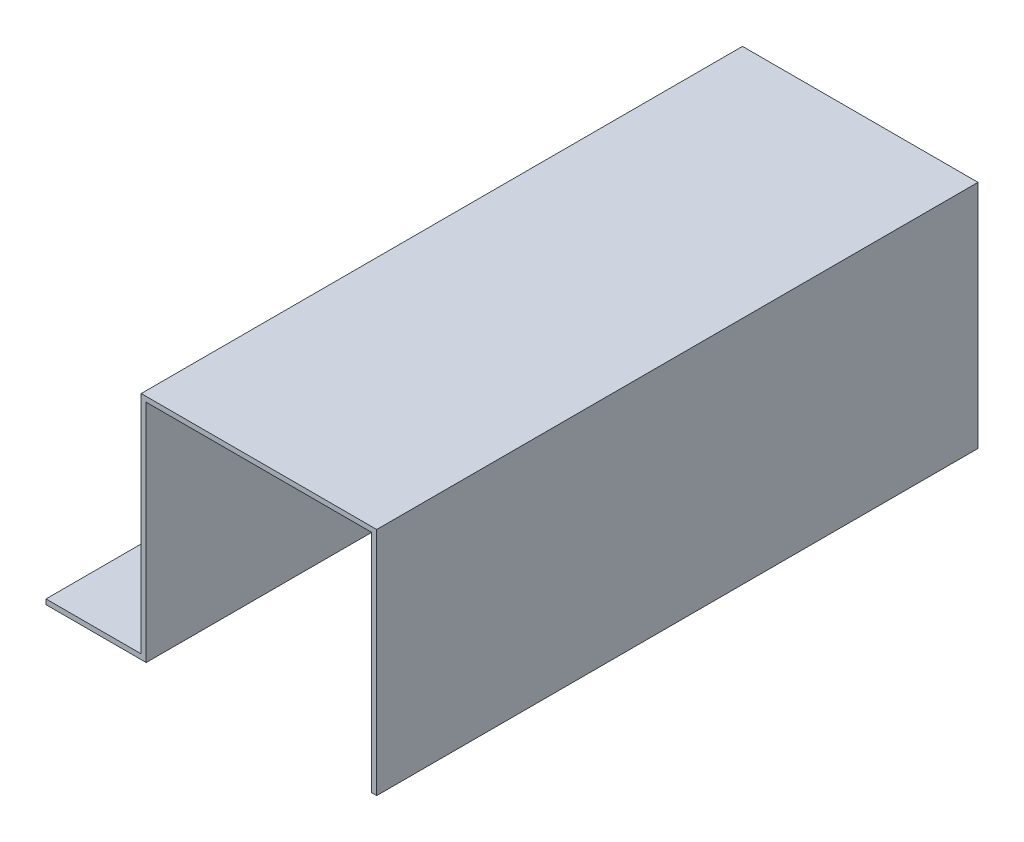
ISO-10303-21;
HEADER;
FILE_DESCRIPTION(('STEP AP214'),'2;1');
FILE_NAME('part.step','',(''),(''),'','','');
FILE_SCHEMA(('AUTOMOTIVE_DESIGN { 1 0 10303 214 1 1 1 1 }'));
ENDSEC;
DATA;
#1=APPLICATION_CONTEXT('core data for automotive mechanical design processes');
#2=APPLICATION_PROTOCOL_DEFINITION('international standard','automotive_design',2000,#1);
#3=PRODUCT_CONTEXT('',#1,'mechanical');
#4=PRODUCT('Part','Part','',(#3));
#5=PRODUCT_RELATED_PRODUCT_CATEGORY('part','',(#4));
#6=PRODUCT_DEFINITION_FORMATION('','',#4);
#7=PRODUCT_DEFINITION_CONTEXT('part definition',#1,'design');
#8=PRODUCT_DEFINITION('design','',#6,#7);
#9=PRODUCT_DEFINITION_SHAPE('','',#8);
#10=(LENGTH_UNIT() NAMED_UNIT(*) SI_UNIT(.MILLI.,.METRE.));
#11=(NAMED_UNIT(*) PLANE_ANGLE_UNIT() SI_UNIT($,.RADIAN.));
#12=(NAMED_UNIT(*) SI_UNIT($,.STERADIAN.) SOLID_ANGLE_UNIT());
#13=UNCERTAINTY_MEASURE_WITH_UNIT(LENGTH_MEASURE(1.E-05),#10,'distance_accuracy_value','');
#14=(GEOMETRIC_REPRESENTATION_CONTEXT(3) GLOBAL_UNCERTAINTY_ASSIGNED_CONTEXT((#13)) GLOBAL_UNIT_ASSIGNED_CONTEXT((#10,
#11,#12)) REPRESENTATION_CONTEXT('',''));
#15=CARTESIAN_POINT('',(0.,0.,0.));
#16=DIRECTION('',(0.,0.,1.));
#17=DIRECTION('',(1.,0.,0.));
#18=AXIS2_PLACEMENT_3D('',#15,#16,#17);
#19=CARTESIAN_POINT('',(0.,0.,120.));
#20=DIRECTION('',(1.,0.,0.));
#21=DIRECTION('',(0.,0.,-1.));
#22=AXIS2_PLACEMENT_3D('',#19,#20,#21);
#23=PLANE('',#22);
#24=DIRECTION('',(0.,-1.,0.));
#25=VECTOR('',#24,1.);
#26=CARTESIAN_POINT('',(0.,0.,0.));
#27=LINE('',#26,#25);
#28=CARTESIAN_POINT('',(0.,1.,0.));
#29=VERTEX_POINT('',#28);
#30=CARTESIAN_POINT('',(0.,0.,0.));
#31=VERTEX_POINT('',#30);
#32=EDGE_CURVE('E151',#29,#31,#27,.T.);
#33=ORIENTED_EDGE('',*,*,#32,.T.);
#34=DIRECTION('',(0.,0.,-1.));
#35=VECTOR('',#34,1.);
#36=CARTESIAN_POINT('',(0.,0.,120.));
#37=LINE('',#36,#35);
#38=CARTESIAN_POINT('',(0.,0.,120.));
#39=VERTEX_POINT('',#38);
#40=EDGE_CURVE('E11',#39,#31,#37,.T.);
#41=ORIENTED_EDGE('',*,*,#40,.F.);
#42=DIRECTION('',(0.,-1.,0.));
#43=VECTOR('',#42,1.);
#44=CARTESIAN_POINT('',(0.,0.,120.));
#45=LINE('',#44,#43);
#46=CARTESIAN_POINT('',(0.,1.,120.));
#47=VERTEX_POINT('',#46);
#48=EDGE_CURVE('E180',#47,#39,#45,.T.);
#49=ORIENTED_EDGE('',*,*,#48,.F.);
#50=DIRECTION('',(0.,0.,-1.));
#51=VECTOR('',#50,1.);
#52=CARTESIAN_POINT('',(0.,1.,120.));
#53=LINE('',#52,#51);
#54=EDGE_CURVE('E147',#47,#29,#53,.T.);
#55=ORIENTED_EDGE('',*,*,#54,.T.);
#56=EDGE_LOOP('',(#33,#41,#49,#55));
#57=FACE_BOUND('',#56,.T.);
#58=ADVANCED_FACE('F38',(#57),#23,.F.);
#59=CARTESIAN_POINT('',(0.,0.,120.));
#60=DIRECTION('',(0.,1.,0.));
#61=DIRECTION('',(0.,0.,1.));
#62=AXIS2_PLACEMENT_3D('',#59,#60,#61);
#63=PLANE('',#62);
#64=CARTESIAN_POINT('',(9.5,0.,30.));
#65=DIRECTION('',(0.,1.,0.));
#66=DIRECTION('',(0.,0.,1.));
#67=AXIS2_PLACEMENT_3D('',#64,#65,#66);
#68=CIRCLE('',#67,2.65);
#69=CARTESIAN_POINT('',(9.5,0.,32.65));
#70=VERTEX_POINT('',#69);
#71=EDGE_CURVE('E156',#70,#70,#68,.T.);
#72=ORIENTED_EDGE('',*,*,#71,.T.);
#73=EDGE_LOOP('',(#72));
#74=FACE_BOUND('',#73,.T.);
#75=CARTESIAN_POINT('',(9.50000000000001,0.,90.));
#76=DIRECTION('',(0.,1.,0.));
#77=DIRECTION('',(0.,0.,1.));
#78=AXIS2_PLACEMENT_3D('',#75,#76,#77);
#79=CIRCLE('',#78,2.65000000000001);
#80=CARTESIAN_POINT('',(9.50000000000001,0.,92.65));
#81=VERTEX_POINT('',#80);
#82=EDGE_CURVE('E245',#81,#81,#79,.T.);
#83=ORIENTED_EDGE('',*,*,#82,.T.);
#84=EDGE_LOOP('',(#83));
#85=FACE_BOUND('',#84,.T.);
#86=DIRECTION('',(1.,0.,0.));
#87=VECTOR('',#86,1.);
#88=CARTESIAN_POINT('',(0.,0.,0.));
#89=LINE('',#88,#87);
#90=CARTESIAN_POINT('',(20.,0.,0.));
#91=VERTEX_POINT('',#90);
#92=EDGE_CURVE('E155',#31,#91,#89,.T.);
#93=ORIENTED_EDGE('',*,*,#92,.T.);
#94=DIRECTION('',(0.,0.,-1.));
#95=VECTOR('',#94,1.);
#96=CARTESIAN_POINT('',(20.,0.,120.));
#97=LINE('',#96,#95);
#98=CARTESIAN_POINT('',(20.,0.,120.));
#99=VERTEX_POINT('',#98);
#100=EDGE_CURVE('E47',#99,#91,#97,.T.);
#101=ORIENTED_EDGE('',*,*,#100,.F.);
#102=DIRECTION('',(1.,0.,0.));
#103=VECTOR('',#102,1.);
#104=CARTESIAN_POINT('',(0.,0.,120.));
#105=LINE('',#104,#103);
#106=EDGE_CURVE('E104',#39,#99,#105,.T.);
#107=ORIENTED_EDGE('',*,*,#106,.F.);
#108=ORIENTED_EDGE('',*,*,#40,.T.);
#109=EDGE_LOOP('',(#93,#101,#107,#108));
#110=FACE_BOUND('',#109,.T.);
#111=ADVANCED_FACE('F273',(#74,#85,#110),#63,.F.);
#112=CARTESIAN_POINT('',(20.,0.,120.));
#113=DIRECTION('',(-1.,0.,0.));
#114=DIRECTION('',(0.,0.,1.));
#115=AXIS2_PLACEMENT_3D('',#112,#113,#114);
#116=PLANE('',#115);
#117=DIRECTION('',(0.,1.,0.));
#118=VECTOR('',#117,1.);
#119=CARTESIAN_POINT('',(20.,0.,0.));
#120=LINE('',#119,#118);
#121=CARTESIAN_POINT('',(20.,45.,0.));
#122=VERTEX_POINT('',#121);
#123=EDGE_CURVE('E159',#91,#122,#120,.T.);
#124=ORIENTED_EDGE('',*,*,#123,.T.);
#125=DIRECTION('',(0.,0.,-1.));
#126=VECTOR('',#125,1.);
#127=CARTESIAN_POINT('',(20.,45.,120.));
#128=LINE('',#127,#126);
#129=CARTESIAN_POINT('',(20.,45.,120.));
#130=VERTEX_POINT('',#129);
#131=EDGE_CURVE('E199',#130,#122,#128,.T.);
#132=ORIENTED_EDGE('',*,*,#131,.F.);
#133=DIRECTION('',(0.,1.,0.));
#134=VECTOR('',#133,1.);
#135=CARTESIAN_POINT('',(20.,0.,120.));
#136=LINE('',#135,#134);
#137=EDGE_CURVE('E209',#99,#130,#136,.T.);
#138=ORIENTED_EDGE('',*,*,#137,.F.);
#139=ORIENTED_EDGE('',*,*,#100,.T.);
#140=EDGE_LOOP('',(#124,#132,#138,#139));
#141=FACE_BOUND('',#140,.T.);
#142=ADVANCED_FACE('F207',(#141),#116,.F.);
#143=CARTESIAN_POINT('',(20.,45.,120.));
#144=DIRECTION('',(0.,1.,0.));
#145=DIRECTION('',(0.,0.,1.));
#146=AXIS2_PLACEMENT_3D('',#143,#144,#145);
#147=PLANE('',#146);
#148=DIRECTION('',(1.,0.,0.));
#149=VECTOR('',#148,1.);
#150=CARTESIAN_POINT('',(20.,45.,0.));
#151=LINE('',#150,#149);
#152=CARTESIAN_POINT('',(65.,45.,0.));
#153=VERTEX_POINT('',#152);
#154=EDGE_CURVE('E162',#122,#153,#151,.T.);
#155=ORIENTED_EDGE('',*,*,#154,.T.);
#156=DIRECTION('',(0.,0.,-1.));
#157=VECTOR('',#156,1.);
#158=CARTESIAN_POINT('',(65.,45.,120.));
#159=LINE('',#158,#157);
#160=CARTESIAN_POINT('',(65.,45.,120.));
#161=VERTEX_POINT('',#160);
#162=EDGE_CURVE('E195',#161,#153,#159,.T.);
#163=ORIENTED_EDGE('',*,*,#162,.F.);
#164=DIRECTION('',(1.,0.,0.));
#165=VECTOR('',#164,1.);
#166=CARTESIAN_POINT('',(20.,45.,120.));
#167=LINE('',#166,#165);
#168=EDGE_CURVE('E228',#130,#161,#167,.T.);
#169=ORIENTED_EDGE('',*,*,#168,.F.);
#170=ORIENTED_EDGE('',*,*,#131,.T.);
#171=EDGE_LOOP('',(#155,#163,#169,#170));
#172=FACE_BOUND('',#171,.T.);
#173=ADVANCED_FACE('F218',(#172),#147,.F.);
#174=CARTESIAN_POINT('',(65.,45.,120.));
#175=DIRECTION('',(1.,0.,0.));
#176=DIRECTION('',(0.,0.,-1.));
#177=AXIS2_PLACEMENT_3D('',#174,#175,#176);
#178=PLANE('',#177);
#179=DIRECTION('',(0.,-1.,0.));
#180=VECTOR('',#179,1.);
#181=CARTESIAN_POINT('',(65.,45.,0.));
#182=LINE('',#181,#180);
#183=CARTESIAN_POINT('',(65.,0.,0.));
#184=VERTEX_POINT('',#183);
#185=EDGE_CURVE('E165',#153,#184,#182,.T.);
#186=ORIENTED_EDGE('',*,*,#185,.T.);
#187=DIRECTION('',(0.,0.,-1.));
#188=VECTOR('',#187,1.);
#189=CARTESIAN_POINT('',(65.,0.,120.));
#190=LINE('',#189,#188);
#191=CARTESIAN_POINT('',(65.,0.,120.));
#192=VERTEX_POINT('',#191);
#193=EDGE_CURVE('E191',#192,#184,#190,.T.);
#194=ORIENTED_EDGE('',*,*,#193,.F.);
#195=DIRECTION('',(0.,-1.,0.));
#196=VECTOR('',#195,1.);
#197=CARTESIAN_POINT('',(65.,45.,120.));
#198=LINE('',#197,#196);
#199=EDGE_CURVE('E224',#161,#192,#198,.T.);
#200=ORIENTED_EDGE('',*,*,#199,.F.);
#201=ORIENTED_EDGE('',*,*,#162,.T.);
#202=EDGE_LOOP('',(#186,#194,#200,#201));
#203=FACE_BOUND('',#202,.T.);
#204=ADVANCED_FACE('F222',(#203),#178,.F.);
#205=CARTESIAN_POINT('',(66.,0.,120.));
#206=DIRECTION('',(0.,1.,0.));
#207=DIRECTION('',(-1.,0.,0.));
#208=AXIS2_PLACEMENT_3D('',#205,#206,#207);
#209=PLANE('',#208);
#210=DIRECTION('',(1.,0.,0.));
#211=VECTOR('',#210,1.);
#212=CARTESIAN_POINT('',(66.,0.,0.));
#213=LINE('',#212,#211);
#214=CARTESIAN_POINT('',(66.,0.,0.));
#215=VERTEX_POINT('',#214);
#216=EDGE_CURVE('E168',#184,#215,#213,.T.);
#217=ORIENTED_EDGE('',*,*,#216,.T.);
#218=DIRECTION('',(0.,0.,-1.));
#219=VECTOR('',#218,1.);
#220=CARTESIAN_POINT('',(66.,0.,120.));
#221=LINE('',#220,#219);
#222=CARTESIAN_POINT('',(66.,0.,120.));
#223=VERTEX_POINT('',#222);
#224=EDGE_CURVE('E187',#223,#215,#221,.T.);
#225=ORIENTED_EDGE('',*,*,#224,.F.);
#226=DIRECTION('',(1.,0.,0.));
#227=VECTOR('',#226,1.);
#228=CARTESIAN_POINT('',(66.,0.,120.));
#229=LINE('',#228,#227);
#230=EDGE_CURVE('E227',#192,#223,#229,.T.);
#231=ORIENTED_EDGE('',*,*,#230,.F.);
#232=ORIENTED_EDGE('',*,*,#193,.T.);
#233=EDGE_LOOP('',(#217,#225,#231,#232));
#234=FACE_BOUND('',#233,.T.);
#235=ADVANCED_FACE('F284',(#234),#209,.F.);
#236=CARTESIAN_POINT('',(66.,46.,120.));
#237=DIRECTION('',(-1.,0.,0.));
#238=DIRECTION('',(0.,0.,1.));
#239=AXIS2_PLACEMENT_3D('',#236,#237,#238);
#240=PLANE('',#239);
#241=DIRECTION('',(0.,1.,0.));
#242=VECTOR('',#241,1.);
#243=CARTESIAN_POINT('',(66.,46.,0.));
#244=LINE('',#243,#242);
#245=CARTESIAN_POINT('',(66.,46.,0.));
#246=VERTEX_POINT('',#245);
#247=EDGE_CURVE('E171',#215,#246,#244,.T.);
#248=ORIENTED_EDGE('',*,*,#247,.T.);
#249=DIRECTION('',(0.,0.,-1.));
#250=VECTOR('',#249,1.);
#251=CARTESIAN_POINT('',(66.,46.,120.));
#252=LINE('',#251,#250);
#253=CARTESIAN_POINT('',(66.,46.,120.));
#254=VERTEX_POINT('',#253);
#255=EDGE_CURVE('E140',#254,#246,#252,.T.);
#256=ORIENTED_EDGE('',*,*,#255,.F.);
#257=DIRECTION('',(0.,1.,0.));
#258=VECTOR('',#257,1.);
#259=CARTESIAN_POINT('',(66.,46.,120.));
#260=LINE('',#259,#258);
#261=EDGE_CURVE('E129',#223,#254,#260,.T.);
#262=ORIENTED_EDGE('',*,*,#261,.F.);
#263=ORIENTED_EDGE('',*,*,#224,.T.);
#264=EDGE_LOOP('',(#248,#256,#262,#263));
#265=FACE_BOUND('',#264,.T.);
#266=ADVANCED_FACE('F281',(#265),#240,.F.);
#267=CARTESIAN_POINT('',(19.,46.,120.));
#268=DIRECTION('',(0.,-1.,0.));
#269=DIRECTION('',(0.,0.,-1.));
#270=AXIS2_PLACEMENT_3D('',#267,#268,#269);
#271=PLANE('',#270);
#272=DIRECTION('',(-1.,0.,0.));
#273=VECTOR('',#272,1.);
#274=CARTESIAN_POINT('',(19.,46.,0.));
#275=LINE('',#274,#273);
#276=CARTESIAN_POINT('',(19.,46.,0.));
#277=VERTEX_POINT('',#276);
#278=EDGE_CURVE('E138',#246,#277,#275,.T.);
#279=ORIENTED_EDGE('',*,*,#278,.T.);
#280=DIRECTION('',(0.,0.,-1.));
#281=VECTOR('',#280,1.);
#282=CARTESIAN_POINT('',(19.,46.,120.));
#283=LINE('',#282,#281);
#284=CARTESIAN_POINT('',(19.,46.,120.));
#285=VERTEX_POINT('',#284);
#286=EDGE_CURVE('E135',#285,#277,#283,.T.);
#287=ORIENTED_EDGE('',*,*,#286,.F.);
#288=DIRECTION('',(-1.,0.,0.));
#289=VECTOR('',#288,1.);
#290=CARTESIAN_POINT('',(19.,46.,120.));
#291=LINE('',#290,#289);
#292=EDGE_CURVE('E123',#254,#285,#291,.T.);
#293=ORIENTED_EDGE('',*,*,#292,.F.);
#294=ORIENTED_EDGE('',*,*,#255,.T.);
#295=EDGE_LOOP('',(#279,#287,#293,#294));
#296=FACE_BOUND('',#295,.T.);
#297=ADVANCED_FACE('F136',(#296),#271,.F.);
#298=CARTESIAN_POINT('',(19.,1.,120.));
#299=DIRECTION('',(1.,0.,0.));
#300=DIRECTION('',(0.,1.,0.));
#301=AXIS2_PLACEMENT_3D('',#298,#299,#300);
#302=PLANE('',#301);
#303=DIRECTION('',(0.,-1.,0.));
#304=VECTOR('',#303,1.);
#305=CARTESIAN_POINT('',(19.,1.,0.));
#306=LINE('',#305,#304);
#307=CARTESIAN_POINT('',(19.,1.,0.));
#308=VERTEX_POINT('',#307);
#309=EDGE_CURVE('E90',#277,#308,#306,.T.);
#310=ORIENTED_EDGE('',*,*,#309,.T.);
#311=DIRECTION('',(0.,0.,-1.));
#312=VECTOR('',#311,1.);
#313=CARTESIAN_POINT('',(19.,1.,120.));
#314=LINE('',#313,#312);
#315=CARTESIAN_POINT('',(19.,1.,120.));
#316=VERTEX_POINT('',#315);
#317=EDGE_CURVE('E141',#316,#308,#314,.T.);
#318=ORIENTED_EDGE('',*,*,#317,.F.);
#319=DIRECTION('',(0.,-1.,0.));
#320=VECTOR('',#319,1.);
#321=CARTESIAN_POINT('',(19.,1.,120.));
#322=LINE('',#321,#320);
#323=EDGE_CURVE('E127',#285,#316,#322,.T.);
#324=ORIENTED_EDGE('',*,*,#323,.F.);
#325=ORIENTED_EDGE('',*,*,#286,.T.);
#326=EDGE_LOOP('',(#310,#318,#324,#325));
#327=FACE_BOUND('',#326,.T.);
#328=ADVANCED_FACE('F143',(#327),#302,.F.);
#329=CARTESIAN_POINT('',(0.,1.,120.));
#330=DIRECTION('',(0.,-1.,0.));
#331=DIRECTION('',(0.,0.,-1.));
#332=AXIS2_PLACEMENT_3D('',#329,#330,#331);
#333=PLANE('',#332);
#334=CARTESIAN_POINT('',(9.5,1.,30.));
#335=DIRECTION('',(0.,1.,0.));
#336=DIRECTION('',(0.,0.,1.));
#337=AXIS2_PLACEMENT_3D('',#334,#335,#336);
#338=CIRCLE('',#337,2.65);
#339=CARTESIAN_POINT('',(9.5,1.,32.65));
#340=VERTEX_POINT('',#339);
#341=EDGE_CURVE('E249',#340,#340,#338,.T.);
#342=ORIENTED_EDGE('',*,*,#341,.F.);
#343=EDGE_LOOP('',(#342));
#344=FACE_BOUND('',#343,.T.);
#345=CARTESIAN_POINT('',(9.50000000000001,1.,90.));
#346=DIRECTION('',(0.,1.,0.));
#347=DIRECTION('',(0.,0.,1.));
#348=AXIS2_PLACEMENT_3D('',#345,#346,#347);
#349=CIRCLE('',#348,2.65000000000001);
#350=CARTESIAN_POINT('',(9.50000000000001,1.,92.65));
#351=VERTEX_POINT('',#350);
#352=EDGE_CURVE('E250',#351,#351,#349,.T.);
#353=ORIENTED_EDGE('',*,*,#352,.F.);
#354=EDGE_LOOP('',(#353));
#355=FACE_BOUND('',#354,.T.);
#356=DIRECTION('',(-1.,0.,0.));
#357=VECTOR('',#356,1.);
#358=CARTESIAN_POINT('',(0.,1.,0.));
#359=LINE('',#358,#357);
#360=EDGE_CURVE('E96',#308,#29,#359,.T.);
#361=ORIENTED_EDGE('',*,*,#360,.T.);
#362=ORIENTED_EDGE('',*,*,#54,.F.);
#363=DIRECTION('',(-1.,0.,0.));
#364=VECTOR('',#363,1.);
#365=CARTESIAN_POINT('',(0.,1.,120.));
#366=LINE('',#365,#364);
#367=EDGE_CURVE('E55',#316,#47,#366,.T.);
#368=ORIENTED_EDGE('',*,*,#367,.F.);
#369=ORIENTED_EDGE('',*,*,#317,.T.);
#370=EDGE_LOOP('',(#361,#362,#368,#369));
#371=FACE_BOUND('',#370,.T.);
#372=ADVANCED_FACE('F261',(#344,#355,#371),#333,.F.);
#373=CARTESIAN_POINT('',(0.,0.,120.));
#374=DIRECTION('',(0.,0.,-1.));
#375=DIRECTION('',(-1.,0.,0.));
#376=AXIS2_PLACEMENT_3D('',#373,#374,#375);
#377=PLANE('',#376);
#378=ORIENTED_EDGE('',*,*,#48,.T.);
#379=ORIENTED_EDGE('',*,*,#106,.T.);
#380=ORIENTED_EDGE('',*,*,#137,.T.);
#381=ORIENTED_EDGE('',*,*,#168,.T.);
#382=ORIENTED_EDGE('',*,*,#199,.T.);
#383=ORIENTED_EDGE('',*,*,#230,.T.);
#384=ORIENTED_EDGE('',*,*,#261,.T.);
#385=ORIENTED_EDGE('',*,*,#292,.T.);
#386=ORIENTED_EDGE('',*,*,#323,.T.);
#387=ORIENTED_EDGE('',*,*,#367,.T.);
#388=EDGE_LOOP('',(#378,#379,#380,#381,#382,#383,#384,#385,#386,#387));
#389=FACE_BOUND('',#388,.T.);
#390=ADVANCED_FACE('F125',(#389),#377,.F.);
#391=CARTESIAN_POINT('',(0.,0.,0.));
#392=DIRECTION('',(0.,0.,-1.));
#393=DIRECTION('',(-1.,0.,0.));
#394=AXIS2_PLACEMENT_3D('',#391,#392,#393);
#395=PLANE('',#394);
#396=ORIENTED_EDGE('',*,*,#32,.F.);
#397=ORIENTED_EDGE('',*,*,#360,.F.);
#398=ORIENTED_EDGE('',*,*,#309,.F.);
#399=ORIENTED_EDGE('',*,*,#278,.F.);
#400=ORIENTED_EDGE('',*,*,#247,.F.);
#401=ORIENTED_EDGE('',*,*,#216,.F.);
#402=ORIENTED_EDGE('',*,*,#185,.F.);
#403=ORIENTED_EDGE('',*,*,#154,.F.);
#404=ORIENTED_EDGE('',*,*,#123,.F.);
#405=ORIENTED_EDGE('',*,*,#92,.F.);
#406=EDGE_LOOP('',(#396,#397,#398,#399,#400,#401,#402,#403,#404,#405));
#407=FACE_BOUND('',#406,.T.);
#408=ADVANCED_FACE('F213',(#407),#395,.T.);
#409=CARTESIAN_POINT('',(9.50000000000001,-199.,90.));
#410=DIRECTION('',(0.,1.,0.));
#411=DIRECTION('',(0.,0.,1.));
#412=AXIS2_PLACEMENT_3D('',#409,#410,#411);
#413=CYLINDRICAL_SURFACE('',#412,2.65000000000001);
#414=ORIENTED_EDGE('',*,*,#352,.T.);
#415=EDGE_LOOP('',(#414));
#416=FACE_BOUND('',#415,.T.);
#417=ORIENTED_EDGE('',*,*,#82,.F.);
#418=EDGE_LOOP('',(#417));
#419=FACE_BOUND('',#418,.T.);
#420=ADVANCED_FACE('F267',(#416,#419),#413,.F.);
#421=CARTESIAN_POINT('',(9.5,-199.,30.));
#422=DIRECTION('',(0.,1.,0.));
#423=DIRECTION('',(0.,0.,1.));
#424=AXIS2_PLACEMENT_3D('',#421,#422,#423);
#425=CYLINDRICAL_SURFACE('',#424,2.65);
#426=ORIENTED_EDGE('',*,*,#341,.T.);
#427=EDGE_LOOP('',(#426));
#428=FACE_BOUND('',#427,.T.);
#429=ORIENTED_EDGE('',*,*,#71,.F.);
#430=EDGE_LOOP('',(#429));
#431=FACE_BOUND('',#430,.T.);
#432=ADVANCED_FACE('F258',(#428,#431),#425,.F.);
#433=CLOSED_SHELL('',(#58,#111,#142,#173,#204,#235,#266,#297,#328,#372,#390,#408,#420,#432));
#434=MANIFOLD_SOLID_BREP('B2',#433);
#435=ADVANCED_BREP_SHAPE_REPRESENTATION('',(#18,#434),#14);
#436=SHAPE_DEFINITION_REPRESENTATION(#9,#435);
ENDSEC;
END-ISO-10303-21;
